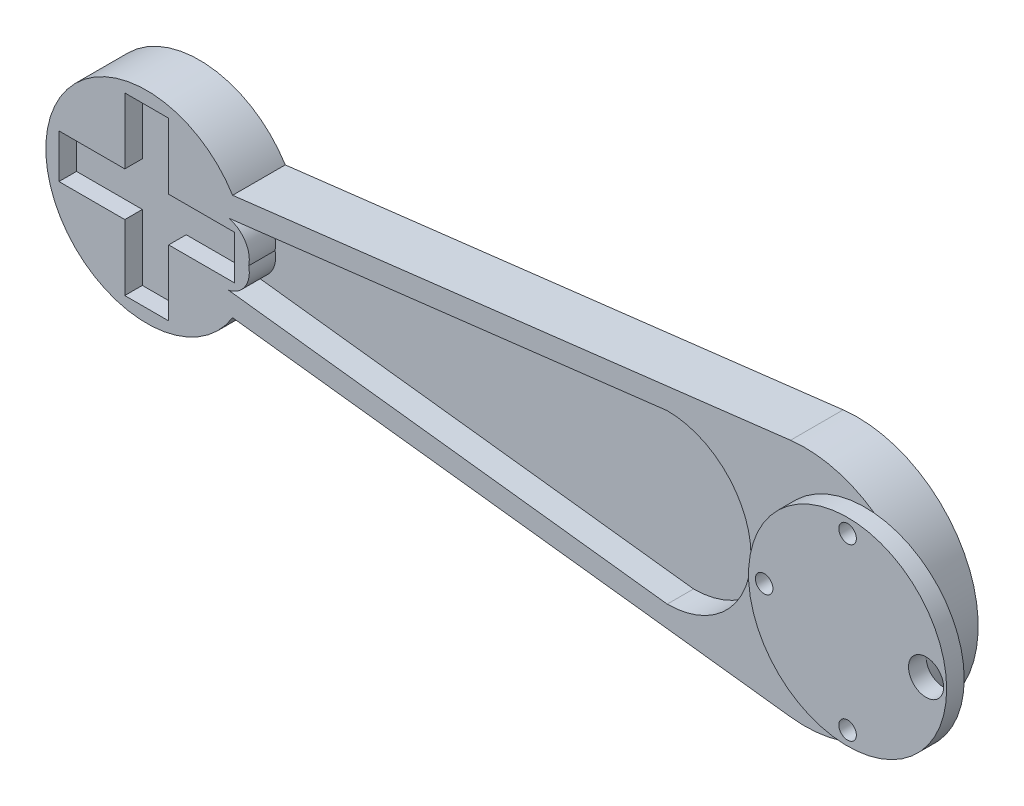
ISO-10303-21;
HEADER;
FILE_DESCRIPTION(('STEP AP214'),'2;1');
FILE_NAME('part.step','',(''),(''),'','','');
FILE_SCHEMA(('AUTOMOTIVE_DESIGN { 1 0 10303 214 1 1 1 1 }'));
ENDSEC;
DATA;
#1=APPLICATION_CONTEXT('core data for automotive mechanical design processes');
#2=APPLICATION_PROTOCOL_DEFINITION('international standard','automotive_design',2000,#1);
#3=PRODUCT_CONTEXT('',#1,'mechanical');
#4=PRODUCT('Part','Part','',(#3));
#5=PRODUCT_RELATED_PRODUCT_CATEGORY('part','',(#4));
#6=PRODUCT_DEFINITION_FORMATION('','',#4);
#7=PRODUCT_DEFINITION_CONTEXT('part definition',#1,'design');
#8=PRODUCT_DEFINITION('design','',#6,#7);
#9=PRODUCT_DEFINITION_SHAPE('','',#8);
#10=(LENGTH_UNIT() NAMED_UNIT(*) SI_UNIT(.MILLI.,.METRE.));
#11=(NAMED_UNIT(*) PLANE_ANGLE_UNIT() SI_UNIT($,.RADIAN.));
#12=(NAMED_UNIT(*) SI_UNIT($,.STERADIAN.) SOLID_ANGLE_UNIT());
#13=UNCERTAINTY_MEASURE_WITH_UNIT(LENGTH_MEASURE(1.E-05),#10,'distance_accuracy_value','');
#14=(GEOMETRIC_REPRESENTATION_CONTEXT(3) GLOBAL_UNCERTAINTY_ASSIGNED_CONTEXT((#13)) GLOBAL_UNIT_ASSIGNED_CONTEXT((#10,
#11,#12)) REPRESENTATION_CONTEXT('',''));
#15=CARTESIAN_POINT('',(0.,0.,0.));
#16=DIRECTION('',(0.,0.,1.));
#17=DIRECTION('',(1.,0.,0.));
#18=AXIS2_PLACEMENT_3D('',#15,#16,#17);
#19=CARTESIAN_POINT('',(9.69578719259024,0.,0.));
#20=DIRECTION('',(0.,0.,1.));
#21=DIRECTION('',(1.,0.,0.));
#22=AXIS2_PLACEMENT_3D('',#19,#20,#21);
#23=PLANE('',#22);
#24=CARTESIAN_POINT('',(9.69578719259024,0.,0.));
#25=DIRECTION('',(0.,0.,1.));
#26=DIRECTION('',(1.,0.,0.));
#27=AXIS2_PLACEMENT_3D('',#24,#25,#26);
#28=CIRCLE('',#27,27.5);
#29=CARTESIAN_POINT('',(6.42598445737751,-27.304915126636,0.));
#30=VERTEX_POINT('',#29);
#31=CARTESIAN_POINT('',(6.42598445737751,27.304915126636,0.));
#32=VERTEX_POINT('',#31);
#33=EDGE_CURVE('E348',#30,#32,#28,.T.);
#34=ORIENTED_EDGE('',*,*,#33,.F.);
#35=DIRECTION('',(0.992906004604945,-0.118901917644099,0.));
#36=VECTOR('',#35,1.);
#37=CARTESIAN_POINT('',(6.42598445737751,-27.304915126636,0.));
#38=LINE('',#37,#36);
#39=CARTESIAN_POINT('',(-120.730550627406,-12.0777377378,0.));
#40=VERTEX_POINT('',#39);
#41=EDGE_CURVE('E366',#40,#30,#38,.T.);
#42=ORIENTED_EDGE('',*,*,#41,.F.);
#43=CARTESIAN_POINT('',(-140.30421280741,0.,0.));
#44=DIRECTION('',(0.,0.,1.));
#45=DIRECTION('',(1.,0.,0.));
#46=AXIS2_PLACEMENT_3D('',#43,#44,#45);
#47=CIRCLE('',#46,23.);
#48=CARTESIAN_POINT('',(-120.730550627406,12.0777377378,0.));
#49=VERTEX_POINT('',#48);
#50=EDGE_CURVE('E364',#49,#40,#47,.T.);
#51=ORIENTED_EDGE('',*,*,#50,.F.);
#52=DIRECTION('',(-0.992906004604945,-0.118901917644099,0.));
#53=VECTOR('',#52,1.);
#54=CARTESIAN_POINT('',(6.42598445737751,27.304915126636,0.));
#55=LINE('',#54,#53);
#56=EDGE_CURVE('E362',#32,#49,#55,.T.);
#57=ORIENTED_EDGE('',*,*,#56,.F.);
#58=EDGE_LOOP('',(#34,#42,#51,#57));
#59=FACE_BOUND('',#58,.T.);
#60=CARTESIAN_POINT('',(4.41668994822247,0.,0.));
#61=DIRECTION('',(0.,0.,1.));
#62=DIRECTION('',(1.,0.,0.));
#63=AXIS2_PLACEMENT_3D('',#60,#61,#62);
#64=CIRCLE('',#63,2.);
#65=CARTESIAN_POINT('',(6.41668994822247,0.,0.));
#66=VERTEX_POINT('',#65);
#67=EDGE_CURVE('E299',#66,#66,#64,.T.);
#68=ORIENTED_EDGE('',*,*,#67,.T.);
#69=EDGE_LOOP('',(#68));
#70=FACE_BOUND('',#69,.T.);
#71=CARTESIAN_POINT('',(23.4332464093947,19.3922579257773,0.));
#72=DIRECTION('',(0.,0.,-1.));
#73=DIRECTION('',(-1.,0.,0.));
#74=AXIS2_PLACEMENT_3D('',#71,#72,#73);
#75=CIRCLE('',#74,2.);
#76=CARTESIAN_POINT('',(21.4332464093947,19.3922579257773,0.));
#77=VERTEX_POINT('',#76);
#78=EDGE_CURVE('E286',#77,#77,#75,.T.);
#79=ORIENTED_EDGE('',*,*,#78,.F.);
#80=EDGE_LOOP('',(#79));
#81=FACE_BOUND('',#80,.T.);
#82=CARTESIAN_POINT('',(23.4332464093947,-19.3922579257773,0.));
#83=DIRECTION('',(0.,0.,1.));
#84=DIRECTION('',(1.,0.,0.));
#85=AXIS2_PLACEMENT_3D('',#82,#83,#84);
#86=CIRCLE('',#85,2.);
#87=CARTESIAN_POINT('',(25.4332464093947,-19.3922579257773,0.));
#88=VERTEX_POINT('',#87);
#89=EDGE_CURVE('E287',#88,#88,#86,.T.);
#90=ORIENTED_EDGE('',*,*,#89,.T.);
#91=EDGE_LOOP('',(#90));
#92=FACE_BOUND('',#91,.T.);
#93=ADVANCED_FACE('F35',(#59,#70,#81,#92),#23,.F.);
#94=CARTESIAN_POINT('',(23.4332464093947,0.,16.));
#95=DIRECTION('',(0.,0.,1.));
#96=DIRECTION('',(1.,0.,0.));
#97=AXIS2_PLACEMENT_3D('',#94,#95,#96);
#98=PLANE('',#97);
#99=CARTESIAN_POINT('',(41.3185826967049,0.,16.));
#100=DIRECTION('',(0.,0.,1.));
#101=DIRECTION('',(1.,0.,0.));
#102=AXIS2_PLACEMENT_3D('',#99,#100,#101);
#103=CIRCLE('',#102,4.00000000000001);
#104=CARTESIAN_POINT('',(45.3185826967049,0.,16.));
#105=VERTEX_POINT('',#104);
#106=EDGE_CURVE('E283',#105,#105,#103,.T.);
#107=ORIENTED_EDGE('',*,*,#106,.F.);
#108=EDGE_LOOP('',(#107));
#109=FACE_BOUND('',#108,.T.);
#110=CARTESIAN_POINT('',(23.4332464093947,19.3922579257773,16.));
#111=DIRECTION('',(0.,0.,-1.));
#112=DIRECTION('',(-1.,0.,0.));
#113=AXIS2_PLACEMENT_3D('',#110,#111,#112);
#114=CIRCLE('',#113,2.);
#115=CARTESIAN_POINT('',(21.4332464093947,19.3922579257773,16.));
#116=VERTEX_POINT('',#115);
#117=EDGE_CURVE('E294',#116,#116,#114,.T.);
#118=ORIENTED_EDGE('',*,*,#117,.T.);
#119=EDGE_LOOP('',(#118));
#120=FACE_BOUND('',#119,.T.);
#121=CARTESIAN_POINT('',(4.41668994822247,0.,16.));
#122=DIRECTION('',(0.,0.,1.));
#123=DIRECTION('',(1.,0.,0.));
#124=AXIS2_PLACEMENT_3D('',#121,#122,#123);
#125=CIRCLE('',#124,2.);
#126=CARTESIAN_POINT('',(6.41668994822247,0.,16.));
#127=VERTEX_POINT('',#126);
#128=EDGE_CURVE('E290',#127,#127,#125,.T.);
#129=ORIENTED_EDGE('',*,*,#128,.F.);
#130=EDGE_LOOP('',(#129));
#131=FACE_BOUND('',#130,.T.);
#132=CARTESIAN_POINT('',(23.4332464093947,0.,16.));
#133=DIRECTION('',(0.,0.,1.));
#134=DIRECTION('',(1.,0.,0.));
#135=AXIS2_PLACEMENT_3D('',#132,#133,#134);
#136=CIRCLE('',#135,22.579968685631);
#137=CARTESIAN_POINT('',(46.0132150950257,0.,16.));
#138=VERTEX_POINT('',#137);
#139=EDGE_CURVE('E305',#138,#138,#136,.T.);
#140=ORIENTED_EDGE('',*,*,#139,.T.);
#141=EDGE_LOOP('',(#140));
#142=FACE_BOUND('',#141,.T.);
#143=CARTESIAN_POINT('',(23.4332464093947,-19.3922579257773,16.));
#144=DIRECTION('',(0.,0.,1.));
#145=DIRECTION('',(1.,0.,0.));
#146=AXIS2_PLACEMENT_3D('',#143,#144,#145);
#147=CIRCLE('',#146,2.);
#148=CARTESIAN_POINT('',(25.4332464093947,-19.3922579257773,16.));
#149=VERTEX_POINT('',#148);
#150=EDGE_CURVE('E291',#149,#149,#147,.T.);
#151=ORIENTED_EDGE('',*,*,#150,.F.);
#152=EDGE_LOOP('',(#151));
#153=FACE_BOUND('',#152,.T.);
#154=ADVANCED_FACE('F421',(#109,#120,#131,#142,#153),#98,.T.);
#155=CARTESIAN_POINT('',(9.69578719259024,0.,12.));
#156=DIRECTION('',(0.,0.,1.));
#157=DIRECTION('',(1.,0.,0.));
#158=AXIS2_PLACEMENT_3D('',#155,#156,#157);
#159=PLANE('',#158);
#160=DIRECTION('',(-1.,0.,0.));
#161=VECTOR('',#160,1.);
#162=CARTESIAN_POINT('',(0.,5.00000000000139,12.));
#163=LINE('',#162,#161);
#164=CARTESIAN_POINT('',(-120.30421280741,5.00000000000017,12.));
#165=VERTEX_POINT('',#164);
#166=CARTESIAN_POINT('',(-135.30421280741,5.00000000000002,12.));
#167=VERTEX_POINT('',#166);
#168=EDGE_CURVE('E51',#165,#167,#163,.T.);
#169=ORIENTED_EDGE('',*,*,#168,.F.);
#170=DIRECTION('',(0.,1.,0.));
#171=VECTOR('',#170,1.);
#172=CARTESIAN_POINT('',(-120.30421280741,0.,12.));
#173=LINE('',#172,#171);
#174=CARTESIAN_POINT('',(-120.30421280741,-4.99999999999983,12.));
#175=VERTEX_POINT('',#174);
#176=EDGE_CURVE('E206',#175,#165,#173,.T.);
#177=ORIENTED_EDGE('',*,*,#176,.F.);
#178=DIRECTION('',(-1.,0.,0.));
#179=VECTOR('',#178,1.);
#180=CARTESIAN_POINT('',(0.,-4.99999999999935,12.));
#181=LINE('',#180,#179);
#182=CARTESIAN_POINT('',(-135.30421280741,-4.99999999999988,12.));
#183=VERTEX_POINT('',#182);
#184=EDGE_CURVE('E209',#175,#183,#181,.T.);
#185=ORIENTED_EDGE('',*,*,#184,.T.);
#186=DIRECTION('',(0.,1.,0.));
#187=VECTOR('',#186,1.);
#188=CARTESIAN_POINT('',(-135.30421280741,0.,12.));
#189=LINE('',#188,#187);
#190=CARTESIAN_POINT('',(-135.30421280741,-20.0000000000002,12.));
#191=VERTEX_POINT('',#190);
#192=EDGE_CURVE('E257',#191,#183,#189,.T.);
#193=ORIENTED_EDGE('',*,*,#192,.F.);
#194=DIRECTION('',(1.,0.,0.));
#195=VECTOR('',#194,1.);
#196=CARTESIAN_POINT('',(0.,-20.0000000000002,12.));
#197=LINE('',#196,#195);
#198=CARTESIAN_POINT('',(-145.30421280741,-20.0000000000002,12.));
#199=VERTEX_POINT('',#198);
#200=EDGE_CURVE('E254',#199,#191,#197,.T.);
#201=ORIENTED_EDGE('',*,*,#200,.F.);
#202=DIRECTION('',(0.,1.,0.));
#203=VECTOR('',#202,1.);
#204=CARTESIAN_POINT('',(-145.30421280741,1.07546721755878E-12,12.));
#205=LINE('',#204,#203);
#206=CARTESIAN_POINT('',(-145.30421280741,-4.99999999999992,12.));
#207=VERTEX_POINT('',#206);
#208=EDGE_CURVE('E251',#199,#207,#205,.T.);
#209=ORIENTED_EDGE('',*,*,#208,.T.);
#210=DIRECTION('',(-1.,0.,0.));
#211=VECTOR('',#210,1.);
#212=CARTESIAN_POINT('',(0.,-4.99999999999934,12.));
#213=LINE('',#212,#211);
#214=CARTESIAN_POINT('',(-160.30421280741,-4.99999999999998,12.));
#215=VERTEX_POINT('',#214);
#216=EDGE_CURVE('E248',#207,#215,#213,.T.);
#217=ORIENTED_EDGE('',*,*,#216,.T.);
#218=DIRECTION('',(0.,1.,0.));
#219=VECTOR('',#218,1.);
#220=CARTESIAN_POINT('',(-160.30421280741,8.89867140015973E-13,12.));
#221=LINE('',#220,#219);
#222=CARTESIAN_POINT('',(-160.30421280741,5.00000000000017,12.));
#223=VERTEX_POINT('',#222);
#224=EDGE_CURVE('E245',#215,#223,#221,.T.);
#225=ORIENTED_EDGE('',*,*,#224,.T.);
#226=DIRECTION('',(-1.,0.,0.));
#227=VECTOR('',#226,1.);
#228=CARTESIAN_POINT('',(0.,4.9999999999986,12.));
#229=LINE('',#228,#227);
#230=CARTESIAN_POINT('',(-145.30421280741,5.00000000000002,12.));
#231=VERTEX_POINT('',#230);
#232=EDGE_CURVE('E242',#231,#223,#229,.T.);
#233=ORIENTED_EDGE('',*,*,#232,.F.);
#234=DIRECTION('',(0.,1.,0.));
#235=VECTOR('',#234,1.);
#236=CARTESIAN_POINT('',(-145.30421280741,0.,12.));
#237=LINE('',#236,#235);
#238=CARTESIAN_POINT('',(-145.30421280741,20.,12.));
#239=VERTEX_POINT('',#238);
#240=EDGE_CURVE('E239',#231,#239,#237,.T.);
#241=ORIENTED_EDGE('',*,*,#240,.T.);
#242=DIRECTION('',(1.,0.,0.));
#243=VECTOR('',#242,1.);
#244=CARTESIAN_POINT('',(4.85722573273435E-13,19.9999999999965,12.));
#245=LINE('',#244,#243);
#246=CARTESIAN_POINT('',(-135.30421280741,19.9999999999998,12.));
#247=VERTEX_POINT('',#246);
#248=EDGE_CURVE('E236',#239,#247,#245,.T.);
#249=ORIENTED_EDGE('',*,*,#248,.T.);
#250=DIRECTION('',(0.,1.,0.));
#251=VECTOR('',#250,1.);
#252=CARTESIAN_POINT('',(-135.30421280741,-2.7539939604388E-12,12.));
#253=LINE('',#252,#251);
#254=EDGE_CURVE('E234',#167,#247,#253,.T.);
#255=ORIENTED_EDGE('',*,*,#254,.F.);
#256=EDGE_LOOP('',(#169,#177,#185,#193,#201,#209,#217,#225,#233,#241,#249,#255));
#257=FACE_BOUND('',#256,.T.);
#258=CARTESIAN_POINT('',(23.4332464093947,0.,12.));
#259=DIRECTION('',(0.,0.,1.));
#260=DIRECTION('',(1.,0.,0.));
#261=AXIS2_PLACEMENT_3D('',#258,#259,#260);
#262=CIRCLE('',#261,22.579968685631);
#263=CARTESIAN_POINT('',(25.5325148225815,22.4821720030221,12.));
#264=VERTEX_POINT('',#263);
#265=CARTESIAN_POINT('',(25.5325148225815,-22.4821720030221,12.));
#266=VERTEX_POINT('',#265);
#267=EDGE_CURVE('E59',#264,#266,#262,.T.);
#268=ORIENTED_EDGE('',*,*,#267,.F.);
#269=CARTESIAN_POINT('',(9.69578719259024,0.,12.));
#270=DIRECTION('',(0.,0.,1.));
#271=DIRECTION('',(1.,0.,0.));
#272=AXIS2_PLACEMENT_3D('',#269,#270,#271);
#273=CIRCLE('',#272,27.5);
#274=CARTESIAN_POINT('',(6.42598445737751,27.304915126636,12.));
#275=VERTEX_POINT('',#274);
#276=EDGE_CURVE('E353',#264,#275,#273,.T.);
#277=ORIENTED_EDGE('',*,*,#276,.T.);
#278=DIRECTION('',(-0.992906004604945,-0.118901917644099,0.));
#279=VECTOR('',#278,1.);
#280=CARTESIAN_POINT('',(6.42598445737751,27.304915126636,12.));
#281=LINE('',#280,#279);
#282=CARTESIAN_POINT('',(-120.730550627406,12.0777377378,12.));
#283=VERTEX_POINT('',#282);
#284=EDGE_CURVE('E351',#275,#283,#281,.T.);
#285=ORIENTED_EDGE('',*,*,#284,.T.);
#286=CARTESIAN_POINT('',(-140.30421280741,0.,12.));
#287=DIRECTION('',(0.,0.,1.));
#288=DIRECTION('',(1.,0.,0.));
#289=AXIS2_PLACEMENT_3D('',#286,#287,#288);
#290=CIRCLE('',#289,23.);
#291=CARTESIAN_POINT('',(-120.730550627406,-12.0777377378,12.));
#292=VERTEX_POINT('',#291);
#293=EDGE_CURVE('E355',#283,#292,#290,.T.);
#294=ORIENTED_EDGE('',*,*,#293,.T.);
#295=DIRECTION('',(0.992906004604945,-0.118901917644099,0.));
#296=VECTOR('',#295,1.);
#297=CARTESIAN_POINT('',(6.42598445737751,-27.304915126636,12.));
#298=LINE('',#297,#296);
#299=CARTESIAN_POINT('',(6.42598445737751,-27.304915126636,12.));
#300=VERTEX_POINT('',#299);
#301=EDGE_CURVE('E357',#292,#300,#298,.T.);
#302=ORIENTED_EDGE('',*,*,#301,.T.);
#303=EDGE_CURVE('E349',#300,#266,#273,.T.);
#304=ORIENTED_EDGE('',*,*,#303,.T.);
#305=EDGE_LOOP('',(#268,#277,#285,#294,#302,#304));
#306=FACE_BOUND('',#305,.T.);
#307=DIRECTION('',(0.992906004604945,-0.118901917644099,0.));
#308=VECTOR('',#307,1.);
#309=CARTESIAN_POINT('',(-121.670322634586,-7.12237792326735,12.));
#310=LINE('',#309,#308);
#311=CARTESIAN_POINT('',(-121.670322634586,-7.12237792326735,12.));
#312=VERTEX_POINT('',#311);
#313=CARTESIAN_POINT('',(-21.6789657167423,-19.0964862781641,12.));
#314=VERTEX_POINT('',#313);
#315=EDGE_CURVE('E313',#312,#314,#310,.T.);
#316=ORIENTED_EDGE('',*,*,#315,.F.);
#317=CARTESIAN_POINT('',(-122.925918752607,-1.25559611802046,12.));
#318=DIRECTION('',(0.,0.,1.));
#319=DIRECTION('',(1.,0.,0.));
#320=AXIS2_PLACEMENT_3D('',#317,#318,#319);
#321=CIRCLE('',#320,5.99963751921431);
#322=CARTESIAN_POINT('',(-117.05913694736,0.,12.));
#323=VERTEX_POINT('',#322);
#324=EDGE_CURVE('E308',#312,#323,#321,.T.);
#325=ORIENTED_EDGE('',*,*,#324,.T.);
#326=CARTESIAN_POINT('',(-122.925918752607,1.25559611802046,12.));
#327=DIRECTION('',(0.,0.,-1.));
#328=DIRECTION('',(-1.,0.,0.));
#329=AXIS2_PLACEMENT_3D('',#326,#327,#328);
#330=CIRCLE('',#329,5.99963751921431);
#331=CARTESIAN_POINT('',(-121.670322634586,7.12237792326735,12.));
#332=VERTEX_POINT('',#331);
#333=EDGE_CURVE('E327',#332,#323,#330,.T.);
#334=ORIENTED_EDGE('',*,*,#333,.F.);
#335=DIRECTION('',(0.992906004604945,0.118901917644099,0.));
#336=VECTOR('',#335,1.);
#337=CARTESIAN_POINT('',(-121.670322634586,7.12237792326735,12.));
#338=LINE('',#337,#336);
#339=CARTESIAN_POINT('',(-21.6789657167423,19.0964862781641,12.));
#340=VERTEX_POINT('',#339);
#341=EDGE_CURVE('E330',#332,#340,#338,.T.);
#342=ORIENTED_EDGE('',*,*,#341,.T.);
#343=CARTESIAN_POINT('',(-21.6703226345828,0.,12.));
#344=DIRECTION('',(0.,0.,1.));
#345=DIRECTION('',(1.,0.,0.));
#346=AXIS2_PLACEMENT_3D('',#343,#344,#345);
#347=CIRCLE('',#346,19.0964882340963);
#348=EDGE_CURVE('E333',#314,#340,#347,.T.);
#349=ORIENTED_EDGE('',*,*,#348,.F.);
#350=EDGE_LOOP('',(#316,#325,#334,#342,#349));
#351=FACE_BOUND('',#350,.T.);
#352=ADVANCED_FACE('F396',(#257,#306,#351),#159,.T.);
#353=CARTESIAN_POINT('',(9.69578719259024,0.,12.));
#354=DIRECTION('',(0.,0.,-1.));
#355=DIRECTION('',(-1.,0.,0.));
#356=AXIS2_PLACEMENT_3D('',#353,#354,#355);
#357=CYLINDRICAL_SURFACE('',#356,27.5);
#358=ORIENTED_EDGE('',*,*,#33,.T.);
#359=DIRECTION('',(0.,0.,-1.));
#360=VECTOR('',#359,1.);
#361=CARTESIAN_POINT('',(6.42598445737751,27.304915126636,12.));
#362=LINE('',#361,#360);
#363=EDGE_CURVE('E11',#275,#32,#362,.T.);
#364=ORIENTED_EDGE('',*,*,#363,.F.);
#365=ORIENTED_EDGE('',*,*,#276,.F.);
#366=EDGE_CURVE('E352',#266,#264,#273,.T.);
#367=ORIENTED_EDGE('',*,*,#366,.F.);
#368=ORIENTED_EDGE('',*,*,#303,.F.);
#369=DIRECTION('',(0.,0.,-1.));
#370=VECTOR('',#369,1.);
#371=CARTESIAN_POINT('',(6.42598445737751,-27.304915126636,12.));
#372=LINE('',#371,#370);
#373=EDGE_CURVE('E359',#300,#30,#372,.T.);
#374=ORIENTED_EDGE('',*,*,#373,.T.);
#375=EDGE_LOOP('',(#358,#364,#365,#367,#368,#374));
#376=FACE_BOUND('',#375,.T.);
#377=ADVANCED_FACE('F37',(#376),#357,.T.);
#378=CARTESIAN_POINT('',(6.42598445737751,27.304915126636,12.));
#379=DIRECTION('',(0.118901917644099,-0.992906004604945,0.));
#380=DIRECTION('',(0.992906004604946,0.118901917644099,0.));
#381=AXIS2_PLACEMENT_3D('',#378,#379,#380);
#382=PLANE('',#381);
#383=ORIENTED_EDGE('',*,*,#56,.T.);
#384=DIRECTION('',(0.,0.,-1.));
#385=VECTOR('',#384,1.);
#386=CARTESIAN_POINT('',(-120.730550627406,12.0777377378,12.));
#387=LINE('',#386,#385);
#388=EDGE_CURVE('E44',#283,#49,#387,.T.);
#389=ORIENTED_EDGE('',*,*,#388,.F.);
#390=ORIENTED_EDGE('',*,*,#284,.F.);
#391=ORIENTED_EDGE('',*,*,#363,.T.);
#392=EDGE_LOOP('',(#383,#389,#390,#391));
#393=FACE_BOUND('',#392,.T.);
#394=ADVANCED_FACE('F398',(#393),#382,.F.);
#395=CARTESIAN_POINT('',(-140.30421280741,0.,12.));
#396=DIRECTION('',(0.,0.,-1.));
#397=DIRECTION('',(-1.,0.,0.));
#398=AXIS2_PLACEMENT_3D('',#395,#396,#397);
#399=CYLINDRICAL_SURFACE('',#398,23.);
#400=ORIENTED_EDGE('',*,*,#50,.T.);
#401=DIRECTION('',(0.,0.,-1.));
#402=VECTOR('',#401,1.);
#403=CARTESIAN_POINT('',(-120.730550627406,-12.0777377378,12.));
#404=LINE('',#403,#402);
#405=EDGE_CURVE('E370',#292,#40,#404,.T.);
#406=ORIENTED_EDGE('',*,*,#405,.F.);
#407=ORIENTED_EDGE('',*,*,#293,.F.);
#408=ORIENTED_EDGE('',*,*,#388,.T.);
#409=EDGE_LOOP('',(#400,#406,#407,#408));
#410=FACE_BOUND('',#409,.T.);
#411=ADVANCED_FACE('F378',(#410),#399,.T.);
#412=CARTESIAN_POINT('',(6.42598445737751,-27.304915126636,12.));
#413=DIRECTION('',(0.118901917644099,0.992906004604945,0.));
#414=DIRECTION('',(-0.992906004604946,0.118901917644099,0.));
#415=AXIS2_PLACEMENT_3D('',#412,#413,#414);
#416=PLANE('',#415);
#417=ORIENTED_EDGE('',*,*,#41,.T.);
#418=ORIENTED_EDGE('',*,*,#373,.F.);
#419=ORIENTED_EDGE('',*,*,#301,.F.);
#420=ORIENTED_EDGE('',*,*,#405,.T.);
#421=EDGE_LOOP('',(#417,#418,#419,#420));
#422=FACE_BOUND('',#421,.T.);
#423=ADVANCED_FACE('F388',(#422),#416,.F.);
#424=CARTESIAN_POINT('',(-122.925918752607,-1.25559611802046,6.));
#425=DIRECTION('',(0.,0.,1.));
#426=DIRECTION('',(1.,0.,0.));
#427=AXIS2_PLACEMENT_3D('',#424,#425,#426);
#428=CYLINDRICAL_SURFACE('',#427,5.99963751921431);
#429=ORIENTED_EDGE('',*,*,#324,.F.);
#430=DIRECTION('',(0.,0.,1.));
#431=VECTOR('',#430,1.);
#432=CARTESIAN_POINT('',(-121.670322634586,-7.12237792326735,6.));
#433=LINE('',#432,#431);
#434=CARTESIAN_POINT('',(-121.670322634586,-7.12237792326735,6.));
#435=VERTEX_POINT('',#434);
#436=EDGE_CURVE('E324',#435,#312,#433,.T.);
#437=ORIENTED_EDGE('',*,*,#436,.F.);
#438=CARTESIAN_POINT('',(-122.925918752607,-1.25559611802046,6.));
#439=DIRECTION('',(0.,0.,1.));
#440=DIRECTION('',(1.,0.,0.));
#441=AXIS2_PLACEMENT_3D('',#438,#439,#440);
#442=CIRCLE('',#441,5.99963751921431);
#443=CARTESIAN_POINT('',(-117.05913694736,0.,6.));
#444=VERTEX_POINT('',#443);
#445=EDGE_CURVE('E310',#435,#444,#442,.T.);
#446=ORIENTED_EDGE('',*,*,#445,.T.);
#447=DIRECTION('',(0.,0.,1.));
#448=VECTOR('',#447,1.);
#449=CARTESIAN_POINT('',(-117.05913694736,0.,6.));
#450=LINE('',#449,#448);
#451=EDGE_CURVE('E346',#444,#323,#450,.T.);
#452=ORIENTED_EDGE('',*,*,#451,.T.);
#453=EDGE_LOOP('',(#429,#437,#446,#452));
#454=FACE_BOUND('',#453,.T.);
#455=ADVANCED_FACE('F433',(#454),#428,.T.);
#456=CARTESIAN_POINT('',(-122.925918752607,1.25559611802046,6.));
#457=DIRECTION('',(0.,0.,1.));
#458=DIRECTION('',(1.,0.,0.));
#459=AXIS2_PLACEMENT_3D('',#456,#457,#458);
#460=CYLINDRICAL_SURFACE('',#459,5.99963751921431);
#461=ORIENTED_EDGE('',*,*,#333,.T.);
#462=ORIENTED_EDGE('',*,*,#451,.F.);
#463=CARTESIAN_POINT('',(-122.925918752607,1.25559611802046,6.));
#464=DIRECTION('',(0.,0.,-1.));
#465=DIRECTION('',(-1.,0.,0.));
#466=AXIS2_PLACEMENT_3D('',#463,#464,#465);
#467=CIRCLE('',#466,5.99963751921431);
#468=CARTESIAN_POINT('',(-121.670322634586,7.12237792326735,6.));
#469=VERTEX_POINT('',#468);
#470=EDGE_CURVE('E312',#469,#444,#467,.T.);
#471=ORIENTED_EDGE('',*,*,#470,.F.);
#472=DIRECTION('',(0.,0.,1.));
#473=VECTOR('',#472,1.);
#474=CARTESIAN_POINT('',(-121.670322634586,7.12237792326735,6.));
#475=LINE('',#474,#473);
#476=EDGE_CURVE('E344',#469,#332,#475,.T.);
#477=ORIENTED_EDGE('',*,*,#476,.T.);
#478=EDGE_LOOP('',(#461,#462,#471,#477));
#479=FACE_BOUND('',#478,.T.);
#480=ADVANCED_FACE('F647',(#479),#460,.T.);
#481=CARTESIAN_POINT('',(-121.670322634586,7.12237792326735,6.));
#482=DIRECTION('',(0.118901917644099,-0.992906004604945,0.));
#483=DIRECTION('',(0.992906004604945,0.118901917644099,0.));
#484=AXIS2_PLACEMENT_3D('',#481,#482,#483);
#485=PLANE('',#484);
#486=ORIENTED_EDGE('',*,*,#341,.F.);
#487=ORIENTED_EDGE('',*,*,#476,.F.);
#488=DIRECTION('',(0.992906004604945,0.118901917644099,0.));
#489=VECTOR('',#488,1.);
#490=CARTESIAN_POINT('',(-121.670322634586,7.12237792326735,6.));
#491=LINE('',#490,#489);
#492=CARTESIAN_POINT('',(-21.6789657167423,19.0964862781641,6.));
#493=VERTEX_POINT('',#492);
#494=EDGE_CURVE('E316',#469,#493,#491,.T.);
#495=ORIENTED_EDGE('',*,*,#494,.T.);
#496=DIRECTION('',(0.,0.,1.));
#497=VECTOR('',#496,1.);
#498=CARTESIAN_POINT('',(-21.6789657167423,19.0964862781641,6.));
#499=LINE('',#498,#497);
#500=EDGE_CURVE('E342',#493,#340,#499,.T.);
#501=ORIENTED_EDGE('',*,*,#500,.T.);
#502=EDGE_LOOP('',(#486,#487,#495,#501));
#503=FACE_BOUND('',#502,.T.);
#504=ADVANCED_FACE('F655',(#503),#485,.T.);
#505=CARTESIAN_POINT('',(-21.6703226345828,0.,6.));
#506=DIRECTION('',(0.,0.,1.));
#507=DIRECTION('',(1.,0.,0.));
#508=AXIS2_PLACEMENT_3D('',#505,#506,#507);
#509=CYLINDRICAL_SURFACE('',#508,19.0964882340963);
#510=ORIENTED_EDGE('',*,*,#348,.T.);
#511=ORIENTED_EDGE('',*,*,#500,.F.);
#512=CARTESIAN_POINT('',(-21.6703226345828,0.,6.));
#513=DIRECTION('',(0.,0.,1.));
#514=DIRECTION('',(1.,0.,0.));
#515=AXIS2_PLACEMENT_3D('',#512,#513,#514);
#516=CIRCLE('',#515,19.0964882340963);
#517=CARTESIAN_POINT('',(-21.6789657167423,-19.0964862781641,6.));
#518=VERTEX_POINT('',#517);
#519=EDGE_CURVE('E318',#518,#493,#516,.T.);
#520=ORIENTED_EDGE('',*,*,#519,.F.);
#521=DIRECTION('',(0.,0.,1.));
#522=VECTOR('',#521,1.);
#523=CARTESIAN_POINT('',(-21.6789657167423,-19.0964862781641,6.));
#524=LINE('',#523,#522);
#525=EDGE_CURVE('E340',#518,#314,#524,.T.);
#526=ORIENTED_EDGE('',*,*,#525,.T.);
#527=EDGE_LOOP('',(#510,#511,#520,#526));
#528=FACE_BOUND('',#527,.T.);
#529=ADVANCED_FACE('F664',(#528),#509,.F.);
#530=CARTESIAN_POINT('',(-121.670322634586,-7.12237792326735,6.));
#531=DIRECTION('',(-0.118901917644099,-0.992906004604945,0.));
#532=DIRECTION('',(0.992906004604945,-0.118901917644099,0.));
#533=AXIS2_PLACEMENT_3D('',#530,#531,#532);
#534=PLANE('',#533);
#535=ORIENTED_EDGE('',*,*,#315,.T.);
#536=ORIENTED_EDGE('',*,*,#525,.F.);
#537=DIRECTION('',(0.992906004604945,-0.118901917644099,0.));
#538=VECTOR('',#537,1.);
#539=CARTESIAN_POINT('',(-121.670322634586,-7.12237792326735,6.));
#540=LINE('',#539,#538);
#541=EDGE_CURVE('E321',#435,#518,#540,.T.);
#542=ORIENTED_EDGE('',*,*,#541,.F.);
#543=ORIENTED_EDGE('',*,*,#436,.T.);
#544=EDGE_LOOP('',(#535,#536,#542,#543));
#545=FACE_BOUND('',#544,.T.);
#546=ADVANCED_FACE('F673',(#545),#534,.F.);
#547=CARTESIAN_POINT('',(-122.925918752607,-1.25559611802046,6.));
#548=DIRECTION('',(0.,0.,1.));
#549=DIRECTION('',(1.,0.,0.));
#550=AXIS2_PLACEMENT_3D('',#547,#548,#549);
#551=PLANE('',#550);
#552=ORIENTED_EDGE('',*,*,#445,.F.);
#553=ORIENTED_EDGE('',*,*,#541,.T.);
#554=ORIENTED_EDGE('',*,*,#519,.T.);
#555=ORIENTED_EDGE('',*,*,#494,.F.);
#556=ORIENTED_EDGE('',*,*,#470,.T.);
#557=EDGE_LOOP('',(#552,#553,#554,#555,#556));
#558=FACE_BOUND('',#557,.T.);
#559=ADVANCED_FACE('F415',(#558),#551,.T.);
#560=CARTESIAN_POINT('',(23.4332464093947,0.,12.));
#561=DIRECTION('',(0.,0.,1.));
#562=DIRECTION('',(1.,0.,0.));
#563=AXIS2_PLACEMENT_3D('',#560,#561,#562);
#564=PLANE('',#563);
#565=CARTESIAN_POINT('',(41.3185826967049,0.,12.));
#566=DIRECTION('',(0.,0.,1.));
#567=DIRECTION('',(1.,0.,0.));
#568=AXIS2_PLACEMENT_3D('',#565,#566,#567);
#569=CIRCLE('',#568,4.00000000000001);
#570=CARTESIAN_POINT('',(45.3185826967049,0.,12.));
#571=VERTEX_POINT('',#570);
#572=EDGE_CURVE('E39',#571,#571,#569,.T.);
#573=ORIENTED_EDGE('',*,*,#572,.T.);
#574=EDGE_LOOP('',(#573));
#575=FACE_BOUND('',#574,.T.);
#576=EDGE_CURVE('E302',#266,#264,#262,.T.);
#577=ORIENTED_EDGE('',*,*,#576,.F.);
#578=ORIENTED_EDGE('',*,*,#366,.T.);
#579=EDGE_LOOP('',(#577,#578));
#580=FACE_BOUND('',#579,.T.);
#581=ADVANCED_FACE('F401',(#575,#580),#564,.F.);
#582=CARTESIAN_POINT('',(23.4332464093947,0.,16.));
#583=DIRECTION('',(0.,0.,-1.));
#584=DIRECTION('',(-1.,0.,0.));
#585=AXIS2_PLACEMENT_3D('',#582,#583,#584);
#586=CYLINDRICAL_SURFACE('',#585,22.579968685631);
#587=ORIENTED_EDGE('',*,*,#139,.F.);
#588=EDGE_LOOP('',(#587));
#589=FACE_BOUND('',#588,.T.);
#590=ORIENTED_EDGE('',*,*,#267,.T.);
#591=ORIENTED_EDGE('',*,*,#576,.T.);
#592=EDGE_LOOP('',(#590,#591));
#593=FACE_BOUND('',#592,.T.);
#594=ADVANCED_FACE('F403',(#589,#593),#586,.T.);
#595=CARTESIAN_POINT('',(4.41668994822247,0.,0.));
#596=DIRECTION('',(0.,0.,1.));
#597=DIRECTION('',(1.,0.,0.));
#598=AXIS2_PLACEMENT_3D('',#595,#596,#597);
#599=CYLINDRICAL_SURFACE('',#598,2.);
#600=ORIENTED_EDGE('',*,*,#67,.F.);
#601=EDGE_LOOP('',(#600));
#602=FACE_BOUND('',#601,.T.);
#603=ORIENTED_EDGE('',*,*,#128,.T.);
#604=EDGE_LOOP('',(#603));
#605=FACE_BOUND('',#604,.T.);
#606=ADVANCED_FACE('F405',(#602,#605),#599,.F.);
#607=CARTESIAN_POINT('',(23.4332464093947,19.3922579257773,0.));
#608=DIRECTION('',(0.,0.,1.));
#609=DIRECTION('',(1.,0.,0.));
#610=AXIS2_PLACEMENT_3D('',#607,#608,#609);
#611=CYLINDRICAL_SURFACE('',#610,2.);
#612=ORIENTED_EDGE('',*,*,#78,.T.);
#613=EDGE_LOOP('',(#612));
#614=FACE_BOUND('',#613,.T.);
#615=ORIENTED_EDGE('',*,*,#117,.F.);
#616=EDGE_LOOP('',(#615));
#617=FACE_BOUND('',#616,.T.);
#618=ADVANCED_FACE('F412',(#614,#617),#611,.F.);
#619=CARTESIAN_POINT('',(23.4332464093947,-19.3922579257773,0.));
#620=DIRECTION('',(0.,0.,1.));
#621=DIRECTION('',(1.,0.,0.));
#622=AXIS2_PLACEMENT_3D('',#619,#620,#621);
#623=CYLINDRICAL_SURFACE('',#622,2.);
#624=ORIENTED_EDGE('',*,*,#89,.F.);
#625=EDGE_LOOP('',(#624));
#626=FACE_BOUND('',#625,.T.);
#627=ORIENTED_EDGE('',*,*,#150,.T.);
#628=EDGE_LOOP('',(#627));
#629=FACE_BOUND('',#628,.T.);
#630=ADVANCED_FACE('F518',(#626,#629),#623,.F.);
#631=CARTESIAN_POINT('',(41.3185826967049,0.,0.));
#632=DIRECTION('',(0.,0.,1.));
#633=DIRECTION('',(1.,0.,0.));
#634=AXIS2_PLACEMENT_3D('',#631,#632,#633);
#635=CYLINDRICAL_SURFACE('',#634,4.00000000000001);
#636=ORIENTED_EDGE('',*,*,#106,.T.);
#637=EDGE_LOOP('',(#636));
#638=FACE_BOUND('',#637,.T.);
#639=ORIENTED_EDGE('',*,*,#572,.F.);
#640=EDGE_LOOP('',(#639));
#641=FACE_BOUND('',#640,.T.);
#642=ADVANCED_FACE('F493',(#638,#641),#635,.F.);
#643=CARTESIAN_POINT('',(0.,5.00000000000139,8.));
#644=DIRECTION('',(0.,1.,0.));
#645=DIRECTION('',(-1.,0.,0.));
#646=AXIS2_PLACEMENT_3D('',#643,#644,#645);
#647=PLANE('',#646);
#648=ORIENTED_EDGE('',*,*,#168,.T.);
#649=DIRECTION('',(0.,0.,1.));
#650=VECTOR('',#649,1.);
#651=CARTESIAN_POINT('',(-135.30421280741,5.00000000000002,8.));
#652=LINE('',#651,#650);
#653=CARTESIAN_POINT('',(-135.30421280741,5.00000000000002,8.));
#654=VERTEX_POINT('',#653);
#655=EDGE_CURVE('E183',#654,#167,#652,.T.);
#656=ORIENTED_EDGE('',*,*,#655,.F.);
#657=DIRECTION('',(-1.,0.,0.));
#658=VECTOR('',#657,1.);
#659=CARTESIAN_POINT('',(0.,5.00000000000139,8.));
#660=LINE('',#659,#658);
#661=CARTESIAN_POINT('',(-120.30421280741,5.00000000000017,8.));
#662=VERTEX_POINT('',#661);
#663=EDGE_CURVE('E187',#662,#654,#660,.T.);
#664=ORIENTED_EDGE('',*,*,#663,.F.);
#665=DIRECTION('',(0.,0.,1.));
#666=VECTOR('',#665,1.);
#667=CARTESIAN_POINT('',(-120.30421280741,5.00000000000017,8.));
#668=LINE('',#667,#666);
#669=EDGE_CURVE('E262',#662,#165,#668,.T.);
#670=ORIENTED_EDGE('',*,*,#669,.T.);
#671=EDGE_LOOP('',(#648,#656,#664,#670));
#672=FACE_BOUND('',#671,.T.);
#673=ADVANCED_FACE('F185',(#672),#647,.F.);
#674=CARTESIAN_POINT('',(-120.30421280741,0.,8.));
#675=DIRECTION('',(1.,0.,0.));
#676=DIRECTION('',(0.,0.,-1.));
#677=AXIS2_PLACEMENT_3D('',#674,#675,#676);
#678=PLANE('',#677);
#679=ORIENTED_EDGE('',*,*,#176,.T.);
#680=ORIENTED_EDGE('',*,*,#669,.F.);
#681=DIRECTION('',(0.,1.,0.));
#682=VECTOR('',#681,1.);
#683=CARTESIAN_POINT('',(-120.30421280741,0.,8.));
#684=LINE('',#683,#682);
#685=CARTESIAN_POINT('',(-120.30421280741,-4.99999999999983,8.));
#686=VERTEX_POINT('',#685);
#687=EDGE_CURVE('E193',#686,#662,#684,.T.);
#688=ORIENTED_EDGE('',*,*,#687,.F.);
#689=DIRECTION('',(0.,0.,1.));
#690=VECTOR('',#689,1.);
#691=CARTESIAN_POINT('',(-120.30421280741,-4.99999999999983,8.));
#692=LINE('',#691,#690);
#693=EDGE_CURVE('E264',#686,#175,#692,.T.);
#694=ORIENTED_EDGE('',*,*,#693,.T.);
#695=EDGE_LOOP('',(#679,#680,#688,#694));
#696=FACE_BOUND('',#695,.T.);
#697=ADVANCED_FACE('F485',(#696),#678,.F.);
#698=CARTESIAN_POINT('',(0.,-4.99999999999935,8.));
#699=DIRECTION('',(0.,1.,0.));
#700=DIRECTION('',(-1.,0.,0.));
#701=AXIS2_PLACEMENT_3D('',#698,#699,#700);
#702=PLANE('',#701);
#703=ORIENTED_EDGE('',*,*,#184,.F.);
#704=ORIENTED_EDGE('',*,*,#693,.F.);
#705=DIRECTION('',(-1.,0.,0.));
#706=VECTOR('',#705,1.);
#707=CARTESIAN_POINT('',(0.,-4.99999999999935,8.));
#708=LINE('',#707,#706);
#709=CARTESIAN_POINT('',(-135.30421280741,-4.99999999999988,8.));
#710=VERTEX_POINT('',#709);
#711=EDGE_CURVE('E230',#686,#710,#708,.T.);
#712=ORIENTED_EDGE('',*,*,#711,.T.);
#713=DIRECTION('',(0.,0.,1.));
#714=VECTOR('',#713,1.);
#715=CARTESIAN_POINT('',(-135.30421280741,-4.99999999999988,8.));
#716=LINE('',#715,#714);
#717=EDGE_CURVE('E266',#710,#183,#716,.T.);
#718=ORIENTED_EDGE('',*,*,#717,.T.);
#719=EDGE_LOOP('',(#703,#704,#712,#718));
#720=FACE_BOUND('',#719,.T.);
#721=ADVANCED_FACE('F483',(#720),#702,.T.);
#722=CARTESIAN_POINT('',(-135.30421280741,0.,8.));
#723=DIRECTION('',(1.,0.,0.));
#724=DIRECTION('',(0.,0.,-1.));
#725=AXIS2_PLACEMENT_3D('',#722,#723,#724);
#726=PLANE('',#725);
#727=ORIENTED_EDGE('',*,*,#192,.T.);
#728=ORIENTED_EDGE('',*,*,#717,.F.);
#729=DIRECTION('',(0.,1.,0.));
#730=VECTOR('',#729,1.);
#731=CARTESIAN_POINT('',(-135.30421280741,0.,8.));
#732=LINE('',#731,#730);
#733=CARTESIAN_POINT('',(-135.30421280741,-20.0000000000002,8.));
#734=VERTEX_POINT('',#733);
#735=EDGE_CURVE('E227',#734,#710,#732,.T.);
#736=ORIENTED_EDGE('',*,*,#735,.F.);
#737=DIRECTION('',(0.,0.,1.));
#738=VECTOR('',#737,1.);
#739=CARTESIAN_POINT('',(-135.30421280741,-20.0000000000002,8.));
#740=LINE('',#739,#738);
#741=EDGE_CURVE('E268',#734,#191,#740,.T.);
#742=ORIENTED_EDGE('',*,*,#741,.T.);
#743=EDGE_LOOP('',(#727,#728,#736,#742));
#744=FACE_BOUND('',#743,.T.);
#745=ADVANCED_FACE('F480',(#744),#726,.F.);
#746=CARTESIAN_POINT('',(0.,-20.0000000000002,8.));
#747=DIRECTION('',(0.,-1.,0.));
#748=DIRECTION('',(1.,0.,0.));
#749=AXIS2_PLACEMENT_3D('',#746,#747,#748);
#750=PLANE('',#749);
#751=ORIENTED_EDGE('',*,*,#200,.T.);
#752=ORIENTED_EDGE('',*,*,#741,.F.);
#753=DIRECTION('',(1.,0.,0.));
#754=VECTOR('',#753,1.);
#755=CARTESIAN_POINT('',(0.,-20.0000000000002,8.));
#756=LINE('',#755,#754);
#757=CARTESIAN_POINT('',(-145.30421280741,-20.0000000000002,8.));
#758=VERTEX_POINT('',#757);
#759=EDGE_CURVE('E224',#758,#734,#756,.T.);
#760=ORIENTED_EDGE('',*,*,#759,.F.);
#761=DIRECTION('',(0.,0.,1.));
#762=VECTOR('',#761,1.);
#763=CARTESIAN_POINT('',(-145.30421280741,-20.0000000000002,8.));
#764=LINE('',#763,#762);
#765=EDGE_CURVE('E270',#758,#199,#764,.T.);
#766=ORIENTED_EDGE('',*,*,#765,.T.);
#767=EDGE_LOOP('',(#751,#752,#760,#766));
#768=FACE_BOUND('',#767,.T.);
#769=ADVANCED_FACE('F475',(#768),#750,.F.);
#770=CARTESIAN_POINT('',(-145.30421280741,1.07546721755878E-12,8.));
#771=DIRECTION('',(1.,0.,0.));
#772=DIRECTION('',(0.,1.,0.));
#773=AXIS2_PLACEMENT_3D('',#770,#771,#772);
#774=PLANE('',#773);
#775=ORIENTED_EDGE('',*,*,#208,.F.);
#776=ORIENTED_EDGE('',*,*,#765,.F.);
#777=DIRECTION('',(0.,1.,0.));
#778=VECTOR('',#777,1.);
#779=CARTESIAN_POINT('',(-145.30421280741,1.07546721755878E-12,8.));
#780=LINE('',#779,#778);
#781=CARTESIAN_POINT('',(-145.30421280741,-4.99999999999992,8.));
#782=VERTEX_POINT('',#781);
#783=EDGE_CURVE('E222',#758,#782,#780,.T.);
#784=ORIENTED_EDGE('',*,*,#783,.T.);
#785=DIRECTION('',(0.,0.,1.));
#786=VECTOR('',#785,1.);
#787=CARTESIAN_POINT('',(-145.30421280741,-4.99999999999992,8.));
#788=LINE('',#787,#786);
#789=EDGE_CURVE('E272',#782,#207,#788,.T.);
#790=ORIENTED_EDGE('',*,*,#789,.T.);
#791=EDGE_LOOP('',(#775,#776,#784,#790));
#792=FACE_BOUND('',#791,.T.);
#793=ADVANCED_FACE('F472',(#792),#774,.T.);
#794=CARTESIAN_POINT('',(0.,-4.99999999999934,8.));
#795=DIRECTION('',(0.,1.,0.));
#796=DIRECTION('',(-1.,0.,0.));
#797=AXIS2_PLACEMENT_3D('',#794,#795,#796);
#798=PLANE('',#797);
#799=ORIENTED_EDGE('',*,*,#216,.F.);
#800=ORIENTED_EDGE('',*,*,#789,.F.);
#801=DIRECTION('',(-1.,0.,0.));
#802=VECTOR('',#801,1.);
#803=CARTESIAN_POINT('',(0.,-4.99999999999934,8.));
#804=LINE('',#803,#802);
#805=CARTESIAN_POINT('',(-160.30421280741,-4.99999999999998,8.));
#806=VERTEX_POINT('',#805);
#807=EDGE_CURVE('E220',#782,#806,#804,.T.);
#808=ORIENTED_EDGE('',*,*,#807,.T.);
#809=DIRECTION('',(0.,0.,1.));
#810=VECTOR('',#809,1.);
#811=CARTESIAN_POINT('',(-160.30421280741,-4.99999999999998,8.));
#812=LINE('',#811,#810);
#813=EDGE_CURVE('E274',#806,#215,#812,.T.);
#814=ORIENTED_EDGE('',*,*,#813,.T.);
#815=EDGE_LOOP('',(#799,#800,#808,#814));
#816=FACE_BOUND('',#815,.T.);
#817=ADVANCED_FACE('F469',(#816),#798,.T.);
#818=CARTESIAN_POINT('',(-160.30421280741,8.89867140015973E-13,8.));
#819=DIRECTION('',(1.,0.,0.));
#820=DIRECTION('',(0.,1.,0.));
#821=AXIS2_PLACEMENT_3D('',#818,#819,#820);
#822=PLANE('',#821);
#823=ORIENTED_EDGE('',*,*,#224,.F.);
#824=ORIENTED_EDGE('',*,*,#813,.F.);
#825=DIRECTION('',(0.,1.,0.));
#826=VECTOR('',#825,1.);
#827=CARTESIAN_POINT('',(-160.30421280741,8.89867140015973E-13,8.));
#828=LINE('',#827,#826);
#829=CARTESIAN_POINT('',(-160.30421280741,5.00000000000017,8.));
#830=VERTEX_POINT('',#829);
#831=EDGE_CURVE('E218',#806,#830,#828,.T.);
#832=ORIENTED_EDGE('',*,*,#831,.T.);
#833=DIRECTION('',(0.,0.,1.));
#834=VECTOR('',#833,1.);
#835=CARTESIAN_POINT('',(-160.30421280741,5.00000000000017,8.));
#836=LINE('',#835,#834);
#837=EDGE_CURVE('E276',#830,#223,#836,.T.);
#838=ORIENTED_EDGE('',*,*,#837,.T.);
#839=EDGE_LOOP('',(#823,#824,#832,#838));
#840=FACE_BOUND('',#839,.T.);
#841=ADVANCED_FACE('F461',(#840),#822,.T.);
#842=CARTESIAN_POINT('',(0.,4.9999999999986,8.));
#843=DIRECTION('',(0.,1.,0.));
#844=DIRECTION('',(-1.,0.,0.));
#845=AXIS2_PLACEMENT_3D('',#842,#843,#844);
#846=PLANE('',#845);
#847=ORIENTED_EDGE('',*,*,#232,.T.);
#848=ORIENTED_EDGE('',*,*,#837,.F.);
#849=DIRECTION('',(-1.,0.,0.));
#850=VECTOR('',#849,1.);
#851=CARTESIAN_POINT('',(0.,4.9999999999986,8.));
#852=LINE('',#851,#850);
#853=CARTESIAN_POINT('',(-145.30421280741,5.00000000000002,8.));
#854=VERTEX_POINT('',#853);
#855=EDGE_CURVE('E215',#854,#830,#852,.T.);
#856=ORIENTED_EDGE('',*,*,#855,.F.);
#857=DIRECTION('',(0.,0.,1.));
#858=VECTOR('',#857,1.);
#859=CARTESIAN_POINT('',(-145.30421280741,5.00000000000002,8.));
#860=LINE('',#859,#858);
#861=EDGE_CURVE('E278',#854,#231,#860,.T.);
#862=ORIENTED_EDGE('',*,*,#861,.T.);
#863=EDGE_LOOP('',(#847,#848,#856,#862));
#864=FACE_BOUND('',#863,.T.);
#865=ADVANCED_FACE('F458',(#864),#846,.F.);
#866=CARTESIAN_POINT('',(-145.30421280741,0.,8.));
#867=DIRECTION('',(1.,0.,0.));
#868=DIRECTION('',(0.,0.,-1.));
#869=AXIS2_PLACEMENT_3D('',#866,#867,#868);
#870=PLANE('',#869);
#871=ORIENTED_EDGE('',*,*,#240,.F.);
#872=ORIENTED_EDGE('',*,*,#861,.F.);
#873=DIRECTION('',(0.,1.,0.));
#874=VECTOR('',#873,1.);
#875=CARTESIAN_POINT('',(-145.30421280741,0.,8.));
#876=LINE('',#875,#874);
#877=CARTESIAN_POINT('',(-145.30421280741,20.,8.));
#878=VERTEX_POINT('',#877);
#879=EDGE_CURVE('E213',#854,#878,#876,.T.);
#880=ORIENTED_EDGE('',*,*,#879,.T.);
#881=DIRECTION('',(0.,0.,1.));
#882=VECTOR('',#881,1.);
#883=CARTESIAN_POINT('',(-145.30421280741,20.,8.));
#884=LINE('',#883,#882);
#885=EDGE_CURVE('E280',#878,#239,#884,.T.);
#886=ORIENTED_EDGE('',*,*,#885,.T.);
#887=EDGE_LOOP('',(#871,#872,#880,#886));
#888=FACE_BOUND('',#887,.T.);
#889=ADVANCED_FACE('F509',(#888),#870,.T.);
#890=CARTESIAN_POINT('',(4.85722573273435E-13,19.9999999999965,8.));
#891=DIRECTION('',(0.,-1.,0.));
#892=DIRECTION('',(1.,0.,0.));
#893=AXIS2_PLACEMENT_3D('',#890,#891,#892);
#894=PLANE('',#893);
#895=ORIENTED_EDGE('',*,*,#248,.F.);
#896=ORIENTED_EDGE('',*,*,#885,.F.);
#897=DIRECTION('',(1.,0.,0.));
#898=VECTOR('',#897,1.);
#899=CARTESIAN_POINT('',(4.85722573273435E-13,19.9999999999965,8.));
#900=LINE('',#899,#898);
#901=CARTESIAN_POINT('',(-135.30421280741,19.9999999999998,8.));
#902=VERTEX_POINT('',#901);
#903=EDGE_CURVE('E201',#878,#902,#900,.T.);
#904=ORIENTED_EDGE('',*,*,#903,.T.);
#905=DIRECTION('',(0.,0.,1.));
#906=VECTOR('',#905,1.);
#907=CARTESIAN_POINT('',(-135.30421280741,19.9999999999998,8.));
#908=LINE('',#907,#906);
#909=EDGE_CURVE('E192',#902,#247,#908,.T.);
#910=ORIENTED_EDGE('',*,*,#909,.T.);
#911=EDGE_LOOP('',(#895,#896,#904,#910));
#912=FACE_BOUND('',#911,.T.);
#913=ADVANCED_FACE('F451',(#912),#894,.T.);
#914=CARTESIAN_POINT('',(-135.30421280741,-2.7539939604388E-12,8.));
#915=DIRECTION('',(1.,0.,0.));
#916=DIRECTION('',(0.,1.,0.));
#917=AXIS2_PLACEMENT_3D('',#914,#915,#916);
#918=PLANE('',#917);
#919=ORIENTED_EDGE('',*,*,#254,.T.);
#920=ORIENTED_EDGE('',*,*,#909,.F.);
#921=DIRECTION('',(0.,1.,0.));
#922=VECTOR('',#921,1.);
#923=CARTESIAN_POINT('',(-135.30421280741,-2.7539939604388E-12,8.));
#924=LINE('',#923,#922);
#925=EDGE_CURVE('E197',#654,#902,#924,.T.);
#926=ORIENTED_EDGE('',*,*,#925,.F.);
#927=ORIENTED_EDGE('',*,*,#655,.T.);
#928=EDGE_LOOP('',(#919,#920,#926,#927));
#929=FACE_BOUND('',#928,.T.);
#930=ADVANCED_FACE('F198',(#929),#918,.F.);
#931=CARTESIAN_POINT('',(0.,0.,8.));
#932=DIRECTION('',(0.,0.,1.));
#933=DIRECTION('',(1.,0.,0.));
#934=AXIS2_PLACEMENT_3D('',#931,#932,#933);
#935=PLANE('',#934);
#936=ORIENTED_EDGE('',*,*,#663,.T.);
#937=ORIENTED_EDGE('',*,*,#925,.T.);
#938=ORIENTED_EDGE('',*,*,#903,.F.);
#939=ORIENTED_EDGE('',*,*,#879,.F.);
#940=ORIENTED_EDGE('',*,*,#855,.T.);
#941=ORIENTED_EDGE('',*,*,#831,.F.);
#942=ORIENTED_EDGE('',*,*,#807,.F.);
#943=ORIENTED_EDGE('',*,*,#783,.F.);
#944=ORIENTED_EDGE('',*,*,#759,.T.);
#945=ORIENTED_EDGE('',*,*,#735,.T.);
#946=ORIENTED_EDGE('',*,*,#711,.F.);
#947=ORIENTED_EDGE('',*,*,#687,.T.);
#948=EDGE_LOOP('',(#936,#937,#938,#939,#940,#941,#942,#943,#944,#945,#946,#947));
#949=FACE_BOUND('',#948,.T.);
#950=ADVANCED_FACE('F203',(#949),#935,.T.);
#951=CLOSED_SHELL('',(#93,#154,#352,#377,#394,#411,#423,#455,#480,#504,#529,#546,#559,#581,#594,
#606,#618,#630,#642,#673,#697,#721,#745,#769,#793,#817,#841,#865,#889,#913,#930,#950));
#952=MANIFOLD_SOLID_BREP('B2',#951);
#953=ADVANCED_BREP_SHAPE_REPRESENTATION('',(#18,#952),#14);
#954=SHAPE_DEFINITION_REPRESENTATION(#9,#953);
ENDSEC;
END-ISO-10303-21;
